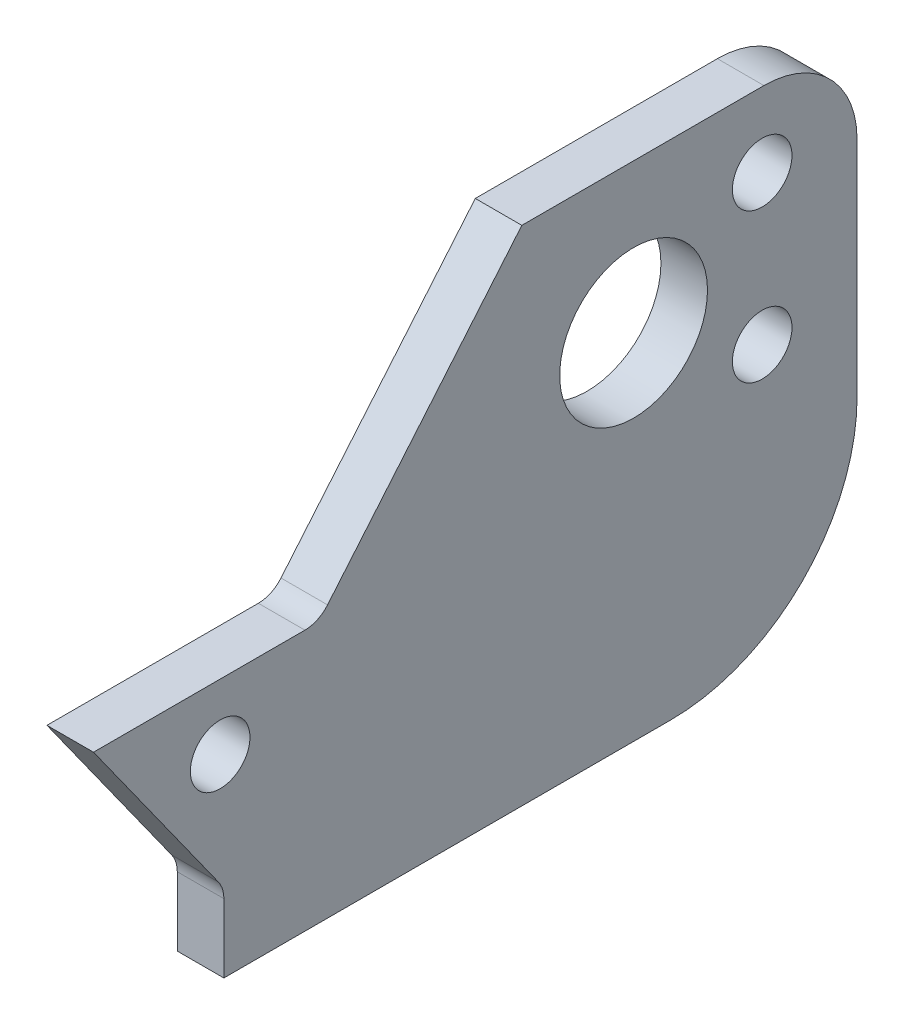
ISO-10303-21;
HEADER;
FILE_DESCRIPTION(('STEP AP214'),'2;1');
FILE_NAME('part.step','',(''),(''),'','','');
FILE_SCHEMA(('AUTOMOTIVE_DESIGN { 1 0 10303 214 1 1 1 1 }'));
ENDSEC;
DATA;
#1=APPLICATION_CONTEXT('core data for automotive mechanical design processes');
#2=APPLICATION_PROTOCOL_DEFINITION('international standard','automotive_design',2000,#1);
#3=PRODUCT_CONTEXT('',#1,'mechanical');
#4=PRODUCT('Part','Part','',(#3));
#5=PRODUCT_RELATED_PRODUCT_CATEGORY('part','',(#4));
#6=PRODUCT_DEFINITION_FORMATION('','',#4);
#7=PRODUCT_DEFINITION_CONTEXT('part definition',#1,'design');
#8=PRODUCT_DEFINITION('design','',#6,#7);
#9=PRODUCT_DEFINITION_SHAPE('','',#8);
#10=(LENGTH_UNIT() NAMED_UNIT(*) SI_UNIT(.MILLI.,.METRE.));
#11=(NAMED_UNIT(*) PLANE_ANGLE_UNIT() SI_UNIT($,.RADIAN.));
#12=(NAMED_UNIT(*) SI_UNIT($,.STERADIAN.) SOLID_ANGLE_UNIT());
#13=UNCERTAINTY_MEASURE_WITH_UNIT(LENGTH_MEASURE(1.E-05),#10,'distance_accuracy_value','');
#14=(GEOMETRIC_REPRESENTATION_CONTEXT(3) GLOBAL_UNCERTAINTY_ASSIGNED_CONTEXT((#13)) GLOBAL_UNIT_ASSIGNED_CONTEXT((#10,
#11,#12)) REPRESENTATION_CONTEXT('',''));
#15=CARTESIAN_POINT('',(0.,0.,0.));
#16=DIRECTION('',(0.,0.,1.));
#17=DIRECTION('',(1.,0.,0.));
#18=AXIS2_PLACEMENT_3D('',#15,#16,#17);
#19=CARTESIAN_POINT('',(9.,6.99999999999999,0.));
#20=DIRECTION('',(0.,1.,0.));
#21=DIRECTION('',(0.,0.,1.));
#22=AXIS2_PLACEMENT_3D('',#19,#20,#21);
#23=PLANE('',#22);
#24=DIRECTION('',(0.,0.,-1.));
#25=VECTOR('',#24,1.);
#26=CARTESIAN_POINT('',(-6.5,6.99999999999999,0.));
#27=LINE('',#26,#25);
#28=CARTESIAN_POINT('',(-6.5,7.,41.));
#29=VERTEX_POINT('',#28);
#30=CARTESIAN_POINT('',(-6.5,6.99999999999999,29.6485586126258));
#31=VERTEX_POINT('',#30);
#32=EDGE_CURVE('E158',#29,#31,#27,.T.);
#33=ORIENTED_EDGE('',*,*,#32,.T.);
#34=DIRECTION('',(-1.,0.,0.));
#35=VECTOR('',#34,1.);
#36=CARTESIAN_POINT('',(9.,6.99999999999999,29.6485586126258));
#37=LINE('',#36,#35);
#38=CARTESIAN_POINT('',(-9.,6.99999999999999,29.6485586126258));
#39=VERTEX_POINT('',#38);
#40=EDGE_CURVE('E232',#31,#39,#37,.T.);
#41=ORIENTED_EDGE('',*,*,#40,.T.);
#42=DIRECTION('',(0.,0.,-1.));
#43=VECTOR('',#42,1.);
#44=CARTESIAN_POINT('',(-9.,6.99999999999999,0.));
#45=LINE('',#44,#43);
#46=CARTESIAN_POINT('',(-9.,7.,41.));
#47=VERTEX_POINT('',#46);
#48=EDGE_CURVE('E161',#47,#39,#45,.T.);
#49=ORIENTED_EDGE('',*,*,#48,.F.);
#50=DIRECTION('',(-1.,0.,0.));
#51=VECTOR('',#50,1.);
#52=CARTESIAN_POINT('',(-6.5,7.,41.));
#53=LINE('',#52,#51);
#54=EDGE_CURVE('E146',#29,#47,#53,.T.);
#55=ORIENTED_EDGE('',*,*,#54,.F.);
#56=EDGE_LOOP('',(#33,#41,#49,#55));
#57=FACE_BOUND('',#56,.T.);
#58=ADVANCED_FACE('F64',(#57),#23,.T.);
#59=CARTESIAN_POINT('',(9.,-6.99999999999999,0.));
#60=DIRECTION('',(0.,1.,0.));
#61=DIRECTION('',(0.,0.,1.));
#62=AXIS2_PLACEMENT_3D('',#59,#60,#61);
#63=PLANE('',#62);
#64=DIRECTION('',(0.,0.,-1.));
#65=VECTOR('',#64,1.);
#66=CARTESIAN_POINT('',(-6.5,-6.99999999999999,0.));
#67=LINE('',#66,#65);
#68=CARTESIAN_POINT('',(-6.5,-7.,34.));
#69=VERTEX_POINT('',#68);
#70=CARTESIAN_POINT('',(-6.5,-7.,10.));
#71=VERTEX_POINT('',#70);
#72=EDGE_CURVE('E300',#69,#71,#67,.T.);
#73=ORIENTED_EDGE('',*,*,#72,.F.);
#74=DIRECTION('',(-1.,0.,0.));
#75=VECTOR('',#74,1.);
#76=CARTESIAN_POINT('',(-6.5,-7.00000000000001,34.));
#77=LINE('',#76,#75);
#78=CARTESIAN_POINT('',(-9.,-7.00000000000001,34.));
#79=VERTEX_POINT('',#78);
#80=EDGE_CURVE('E164',#69,#79,#77,.T.);
#81=ORIENTED_EDGE('',*,*,#80,.T.);
#82=DIRECTION('',(0.,0.,-1.));
#83=VECTOR('',#82,1.);
#84=CARTESIAN_POINT('',(-9.,-6.99999999999999,0.));
#85=LINE('',#84,#83);
#86=CARTESIAN_POINT('',(-9.,-7.,10.));
#87=VERTEX_POINT('',#86);
#88=EDGE_CURVE('E190',#79,#87,#85,.T.);
#89=ORIENTED_EDGE('',*,*,#88,.T.);
#90=DIRECTION('',(-1.,0.,0.));
#91=VECTOR('',#90,1.);
#92=CARTESIAN_POINT('',(-6.5,-7.,10.));
#93=LINE('',#92,#91);
#94=EDGE_CURVE('E225',#87,#71,#93,.F.);
#95=ORIENTED_EDGE('',*,*,#94,.T.);
#96=EDGE_LOOP('',(#73,#81,#89,#95));
#97=FACE_BOUND('',#96,.T.);
#98=ADVANCED_FACE('F265',(#97),#63,.F.);
#99=CARTESIAN_POINT('',(9.,20.,0.));
#100=DIRECTION('',(0.,1.,0.));
#101=DIRECTION('',(0.,0.,1.));
#102=AXIS2_PLACEMENT_3D('',#99,#100,#101);
#103=PLANE('',#102);
#104=DIRECTION('',(0.,0.,-1.));
#105=VECTOR('',#104,1.);
#106=CARTESIAN_POINT('',(-6.5,20.,0.));
#107=LINE('',#106,#105);
#108=CARTESIAN_POINT('',(-6.5,20.,18.));
#109=VERTEX_POINT('',#108);
#110=CARTESIAN_POINT('',(-6.5,20.,5.));
#111=VERTEX_POINT('',#110);
#112=EDGE_CURVE('E181',#109,#111,#107,.T.);
#113=ORIENTED_EDGE('',*,*,#112,.T.);
#114=DIRECTION('',(-1.,0.,0.));
#115=VECTOR('',#114,1.);
#116=CARTESIAN_POINT('',(9.,20.,5.));
#117=LINE('',#116,#115);
#118=CARTESIAN_POINT('',(-9.,20.,5.));
#119=VERTEX_POINT('',#118);
#120=EDGE_CURVE('E204',#111,#119,#117,.T.);
#121=ORIENTED_EDGE('',*,*,#120,.T.);
#122=DIRECTION('',(0.,0.,-1.));
#123=VECTOR('',#122,1.);
#124=CARTESIAN_POINT('',(-9.,20.,0.));
#125=LINE('',#124,#123);
#126=CARTESIAN_POINT('',(-9.,20.,18.));
#127=VERTEX_POINT('',#126);
#128=EDGE_CURVE('E172',#127,#119,#125,.T.);
#129=ORIENTED_EDGE('',*,*,#128,.F.);
#130=DIRECTION('',(-1.,0.,0.));
#131=VECTOR('',#130,1.);
#132=CARTESIAN_POINT('',(9.,20.,18.));
#133=LINE('',#132,#131);
#134=EDGE_CURVE('E197',#109,#127,#133,.T.);
#135=ORIENTED_EDGE('',*,*,#134,.F.);
#136=EDGE_LOOP('',(#113,#121,#129,#135));
#137=FACE_BOUND('',#136,.T.);
#138=ADVANCED_FACE('F271',(#137),#103,.T.);
#139=CARTESIAN_POINT('',(9.,17.1267880004407,20.4109111291244));
#140=DIRECTION('',(0.,-0.642787609686543,-0.766044443118975));
#141=DIRECTION('',(0.,0.766044443118975,-0.642787609686543));
#142=AXIS2_PLACEMENT_3D('',#139,#140,#141);
#143=PLANE('',#142);
#144=DIRECTION('',(0.,-0.766044443118975,0.642787609686543));
#145=VECTOR('',#144,1.);
#146=CARTESIAN_POINT('',(-9.,17.1267880004407,20.4109111291244));
#147=LINE('',#146,#145);
#148=CARTESIAN_POINT('',(-9.,7.5670746696226,28.4324630591744));
#149=VERTEX_POINT('',#148);
#150=EDGE_CURVE('E179',#127,#149,#147,.T.);
#151=ORIENTED_EDGE('',*,*,#150,.T.);
#152=DIRECTION('',(-1.,0.,0.));
#153=VECTOR('',#152,1.);
#154=CARTESIAN_POINT('',(9.,7.5670746696226,28.4324630591744));
#155=LINE('',#154,#153);
#156=CARTESIAN_POINT('',(-6.5,7.5670746696226,28.4324630591744));
#157=VERTEX_POINT('',#156);
#158=EDGE_CURVE('E234',#149,#157,#155,.F.);
#159=ORIENTED_EDGE('',*,*,#158,.T.);
#160=DIRECTION('',(0.,-0.766044443118975,0.642787609686543));
#161=VECTOR('',#160,1.);
#162=CARTESIAN_POINT('',(-6.5,17.1267880004407,20.4109111291244));
#163=LINE('',#162,#161);
#164=EDGE_CURVE('E173',#109,#157,#163,.T.);
#165=ORIENTED_EDGE('',*,*,#164,.F.);
#166=ORIENTED_EDGE('',*,*,#134,.T.);
#167=EDGE_LOOP('',(#151,#159,#165,#166));
#168=FACE_BOUND('',#167,.T.);
#169=ADVANCED_FACE('F248',(#168),#143,.F.);
#170=CARTESIAN_POINT('',(9.,0.,0.));
#171=DIRECTION('',(0.,0.,-1.));
#172=DIRECTION('',(0.,1.,0.));
#173=AXIS2_PLACEMENT_3D('',#170,#171,#172);
#174=PLANE('',#173);
#175=DIRECTION('',(0.,-1.,0.));
#176=VECTOR('',#175,1.);
#177=CARTESIAN_POINT('',(-6.5,0.,0.));
#178=LINE('',#177,#176);
#179=CARTESIAN_POINT('',(-6.5,15.,0.));
#180=VERTEX_POINT('',#179);
#181=CARTESIAN_POINT('',(-6.5,3.,0.));
#182=VERTEX_POINT('',#181);
#183=EDGE_CURVE('E200',#180,#182,#178,.T.);
#184=ORIENTED_EDGE('',*,*,#183,.T.);
#185=DIRECTION('',(-1.,0.,0.));
#186=VECTOR('',#185,1.);
#187=CARTESIAN_POINT('',(-9.,3.,0.));
#188=LINE('',#187,#186);
#189=CARTESIAN_POINT('',(-9.,3.,0.));
#190=VERTEX_POINT('',#189);
#191=EDGE_CURVE('E217',#182,#190,#188,.T.);
#192=ORIENTED_EDGE('',*,*,#191,.T.);
#193=DIRECTION('',(0.,-1.,0.));
#194=VECTOR('',#193,1.);
#195=CARTESIAN_POINT('',(-9.,0.,0.));
#196=LINE('',#195,#194);
#197=CARTESIAN_POINT('',(-9.,15.,0.));
#198=VERTEX_POINT('',#197);
#199=EDGE_CURVE('E193',#198,#190,#196,.T.);
#200=ORIENTED_EDGE('',*,*,#199,.F.);
#201=DIRECTION('',(-1.,0.,0.));
#202=VECTOR('',#201,1.);
#203=CARTESIAN_POINT('',(9.,15.,0.));
#204=LINE('',#203,#202);
#205=EDGE_CURVE('E211',#198,#180,#204,.F.);
#206=ORIENTED_EDGE('',*,*,#205,.T.);
#207=EDGE_LOOP('',(#184,#192,#200,#206));
#208=FACE_BOUND('',#207,.T.);
#209=ADVANCED_FACE('F277',(#208),#174,.T.);
#210=CARTESIAN_POINT('',(-9.,0.,0.));
#211=DIRECTION('',(1.,0.,0.));
#212=DIRECTION('',(0.,0.,-1.));
#213=AXIS2_PLACEMENT_3D('',#210,#211,#212);
#214=PLANE('',#213);
#215=CARTESIAN_POINT('',(-9.,3.5,34.1988373664787));
#216=DIRECTION('',(-1.,0.,0.));
#217=DIRECTION('',(0.,0.,1.));
#218=AXIS2_PLACEMENT_3D('',#215,#216,#217);
#219=CIRCLE('',#218,1.59999999999999);
#220=CARTESIAN_POINT('',(-9.,3.5,35.7988373664787));
#221=VERTEX_POINT('',#220);
#222=EDGE_CURVE('E348',#221,#221,#219,.T.);
#223=ORIENTED_EDGE('',*,*,#222,.F.);
#224=EDGE_LOOP('',(#223));
#225=FACE_BOUND('',#224,.T.);
#226=CARTESIAN_POINT('',(-9.,8.,5.0949004351856));
#227=DIRECTION('',(-1.,0.,0.));
#228=DIRECTION('',(0.,0.,1.));
#229=AXIS2_PLACEMENT_3D('',#226,#227,#228);
#230=CIRCLE('',#229,1.59999999999999);
#231=CARTESIAN_POINT('',(-9.,8.,6.69490043518559));
#232=VERTEX_POINT('',#231);
#233=EDGE_CURVE('E340',#232,#232,#230,.T.);
#234=ORIENTED_EDGE('',*,*,#233,.F.);
#235=EDGE_LOOP('',(#234));
#236=FACE_BOUND('',#235,.T.);
#237=CARTESIAN_POINT('',(-9.,16.,5.0949004351856));
#238=DIRECTION('',(-1.,0.,0.));
#239=DIRECTION('',(0.,0.,1.));
#240=AXIS2_PLACEMENT_3D('',#237,#238,#239);
#241=CIRCLE('',#240,1.59999999999999);
#242=CARTESIAN_POINT('',(-9.,16.,6.69490043518559));
#243=VERTEX_POINT('',#242);
#244=EDGE_CURVE('E332',#243,#243,#241,.T.);
#245=ORIENTED_EDGE('',*,*,#244,.F.);
#246=EDGE_LOOP('',(#245));
#247=FACE_BOUND('',#246,.T.);
#248=CARTESIAN_POINT('',(-9.,12.,12.));
#249=DIRECTION('',(1.,0.,0.));
#250=DIRECTION('',(0.,0.,-1.));
#251=AXIS2_PLACEMENT_3D('',#248,#249,#250);
#252=CIRCLE('',#251,3.96875);
#253=CARTESIAN_POINT('',(-9.,12.,8.03125));
#254=VERTEX_POINT('',#253);
#255=EDGE_CURVE('E309',#254,#254,#252,.T.);
#256=ORIENTED_EDGE('',*,*,#255,.T.);
#257=EDGE_LOOP('',(#256));
#258=FACE_BOUND('',#257,.T.);
#259=DIRECTION('',(0.,-1.,0.));
#260=VECTOR('',#259,1.);
#261=CARTESIAN_POINT('',(-9.,-2.79999999999999,34.));
#262=LINE('',#261,#260);
#263=CARTESIAN_POINT('',(-9.,-3.30873827228603,34.));
#264=VERTEX_POINT('',#263);
#265=EDGE_CURVE('E152',#264,#79,#262,.T.);
#266=ORIENTED_EDGE('',*,*,#265,.F.);
#267=CARTESIAN_POINT('',(-9.,-3.30873827228603,35.5875));
#268=DIRECTION('',(1.,0.,0.));
#269=DIRECTION('',(0.,0.,-1.));
#270=AXIS2_PLACEMENT_3D('',#267,#268,#269);
#271=CIRCLE('',#270,1.5875);
#272=CARTESIAN_POINT('',(-9.,-2.38602263975696,34.2956981144593));
#273=VERTEX_POINT('',#272);
#274=EDGE_CURVE('E72',#264,#273,#271,.T.);
#275=ORIENTED_EDGE('',*,*,#274,.T.);
#276=DIRECTION('',(0.,-0.813733471206735,-0.581238193719097));
#277=VECTOR('',#276,1.);
#278=CARTESIAN_POINT('',(-9.,7.,41.));
#279=LINE('',#278,#277);
#280=EDGE_CURVE('E323',#47,#273,#279,.T.);
#281=ORIENTED_EDGE('',*,*,#280,.F.);
#282=ORIENTED_EDGE('',*,*,#48,.T.);
#283=CARTESIAN_POINT('',(-9.,8.5875,29.6485586126258));
#284=DIRECTION('',(1.,0.,0.));
#285=DIRECTION('',(0.,0.,-1.));
#286=AXIS2_PLACEMENT_3D('',#283,#284,#285);
#287=CIRCLE('',#286,1.5875);
#288=EDGE_CURVE('E240',#39,#149,#287,.T.);
#289=ORIENTED_EDGE('',*,*,#288,.T.);
#290=ORIENTED_EDGE('',*,*,#150,.F.);
#291=ORIENTED_EDGE('',*,*,#128,.T.);
#292=CARTESIAN_POINT('',(-9.,15.,5.));
#293=DIRECTION('',(1.,0.,0.));
#294=DIRECTION('',(0.,0.,-1.));
#295=AXIS2_PLACEMENT_3D('',#292,#293,#294);
#296=CIRCLE('',#295,5.);
#297=EDGE_CURVE('E208',#119,#198,#296,.F.);
#298=ORIENTED_EDGE('',*,*,#297,.T.);
#299=ORIENTED_EDGE('',*,*,#199,.T.);
#300=CARTESIAN_POINT('',(-9.,3.,10.));
#301=DIRECTION('',(1.,0.,0.));
#302=DIRECTION('',(0.,0.,-1.));
#303=AXIS2_PLACEMENT_3D('',#300,#301,#302);
#304=CIRCLE('',#303,10.);
#305=EDGE_CURVE('E221',#190,#87,#304,.F.);
#306=ORIENTED_EDGE('',*,*,#305,.T.);
#307=ORIENTED_EDGE('',*,*,#88,.F.);
#308=EDGE_LOOP('',(#266,#275,#281,#282,#289,#290,#291,#298,#299,#306,#307));
#309=FACE_BOUND('',#308,.T.);
#310=ADVANCED_FACE('F243',(#225,#236,#247,#258,#309),#214,.F.);
#311=CARTESIAN_POINT('',(-6.5,0.,0.));
#312=DIRECTION('',(1.,0.,0.));
#313=DIRECTION('',(0.,0.,-1.));
#314=AXIS2_PLACEMENT_3D('',#311,#312,#313);
#315=PLANE('',#314);
#316=CARTESIAN_POINT('',(-6.5,3.5,34.1988373664787));
#317=DIRECTION('',(1.,0.,0.));
#318=DIRECTION('',(0.,0.,-1.));
#319=AXIS2_PLACEMENT_3D('',#316,#317,#318);
#320=CIRCLE('',#319,1.59999999999999);
#321=CARTESIAN_POINT('',(-6.5,3.5,32.5988373664787));
#322=VERTEX_POINT('',#321);
#323=EDGE_CURVE('E344',#322,#322,#320,.F.);
#324=ORIENTED_EDGE('',*,*,#323,.T.);
#325=EDGE_LOOP('',(#324));
#326=FACE_BOUND('',#325,.T.);
#327=CARTESIAN_POINT('',(-6.5,8.,5.0949004351856));
#328=DIRECTION('',(1.,0.,0.));
#329=DIRECTION('',(0.,0.,-1.));
#330=AXIS2_PLACEMENT_3D('',#327,#328,#329);
#331=CIRCLE('',#330,1.59999999999999);
#332=CARTESIAN_POINT('',(-6.5,8.,3.4949004351856));
#333=VERTEX_POINT('',#332);
#334=EDGE_CURVE('E336',#333,#333,#331,.F.);
#335=ORIENTED_EDGE('',*,*,#334,.T.);
#336=EDGE_LOOP('',(#335));
#337=FACE_BOUND('',#336,.T.);
#338=CARTESIAN_POINT('',(-6.5,16.,5.0949004351856));
#339=DIRECTION('',(1.,0.,0.));
#340=DIRECTION('',(0.,0.,-1.));
#341=AXIS2_PLACEMENT_3D('',#338,#339,#340);
#342=CIRCLE('',#341,1.6);
#343=CARTESIAN_POINT('',(-6.5,16.,3.4949004351856));
#344=VERTEX_POINT('',#343);
#345=EDGE_CURVE('E326',#344,#344,#342,.F.);
#346=ORIENTED_EDGE('',*,*,#345,.T.);
#347=EDGE_LOOP('',(#346));
#348=FACE_BOUND('',#347,.T.);
#349=DIRECTION('',(0.,-0.813733471206735,-0.581238193719097));
#350=VECTOR('',#349,1.);
#351=CARTESIAN_POINT('',(-6.5,7.,41.));
#352=LINE('',#351,#350);
#353=CARTESIAN_POINT('',(-6.5,-2.38602263975696,34.2956981144593));
#354=VERTEX_POINT('',#353);
#355=EDGE_CURVE('E143',#29,#354,#352,.T.);
#356=ORIENTED_EDGE('',*,*,#355,.T.);
#357=CARTESIAN_POINT('',(-6.5,-3.30873827228603,35.5875));
#358=DIRECTION('',(1.,0.,0.));
#359=DIRECTION('',(0.,0.,-1.));
#360=AXIS2_PLACEMENT_3D('',#357,#358,#359);
#361=CIRCLE('',#360,1.5875);
#362=CARTESIAN_POINT('',(-6.5,-3.30873827228603,34.));
#363=VERTEX_POINT('',#362);
#364=EDGE_CURVE('E12',#354,#363,#361,.F.);
#365=ORIENTED_EDGE('',*,*,#364,.T.);
#366=DIRECTION('',(0.,-1.,0.));
#367=VECTOR('',#366,1.);
#368=CARTESIAN_POINT('',(-6.5,-2.79999999999999,34.));
#369=LINE('',#368,#367);
#370=EDGE_CURVE('E151',#363,#69,#369,.T.);
#371=ORIENTED_EDGE('',*,*,#370,.T.);
#372=ORIENTED_EDGE('',*,*,#72,.T.);
#373=CARTESIAN_POINT('',(-6.5,3.,10.));
#374=DIRECTION('',(1.,0.,0.));
#375=DIRECTION('',(0.,0.,-1.));
#376=AXIS2_PLACEMENT_3D('',#373,#374,#375);
#377=CIRCLE('',#376,10.);
#378=EDGE_CURVE('E229',#71,#182,#377,.T.);
#379=ORIENTED_EDGE('',*,*,#378,.T.);
#380=ORIENTED_EDGE('',*,*,#183,.F.);
#381=CARTESIAN_POINT('',(-6.5,15.,5.));
#382=DIRECTION('',(1.,0.,0.));
#383=DIRECTION('',(0.,0.,-1.));
#384=AXIS2_PLACEMENT_3D('',#381,#382,#383);
#385=CIRCLE('',#384,5.);
#386=EDGE_CURVE('E214',#180,#111,#385,.T.);
#387=ORIENTED_EDGE('',*,*,#386,.T.);
#388=ORIENTED_EDGE('',*,*,#112,.F.);
#389=ORIENTED_EDGE('',*,*,#164,.T.);
#390=CARTESIAN_POINT('',(-6.5,8.5875,29.6485586126258));
#391=DIRECTION('',(1.,0.,0.));
#392=DIRECTION('',(0.,0.,-1.));
#393=AXIS2_PLACEMENT_3D('',#390,#391,#392);
#394=CIRCLE('',#393,1.5875);
#395=EDGE_CURVE('E170',#157,#31,#394,.F.);
#396=ORIENTED_EDGE('',*,*,#395,.T.);
#397=ORIENTED_EDGE('',*,*,#32,.F.);
#398=EDGE_LOOP('',(#356,#365,#371,#372,#379,#380,#387,#388,#389,#396,#397));
#399=FACE_BOUND('',#398,.T.);
#400=CARTESIAN_POINT('',(-6.5,12.,12.));
#401=DIRECTION('',(1.,0.,0.));
#402=DIRECTION('',(0.,0.,-1.));
#403=AXIS2_PLACEMENT_3D('',#400,#401,#402);
#404=CIRCLE('',#403,3.96875);
#405=CARTESIAN_POINT('',(-6.5,12.,8.03125));
#406=VERTEX_POINT('',#405);
#407=EDGE_CURVE('E163',#406,#406,#404,.T.);
#408=ORIENTED_EDGE('',*,*,#407,.F.);
#409=EDGE_LOOP('',(#408));
#410=FACE_BOUND('',#409,.T.);
#411=ADVANCED_FACE('F166',(#326,#337,#348,#399,#410),#315,.T.);
#412=CARTESIAN_POINT('',(-12.5,12.,12.));
#413=DIRECTION('',(1.,0.,0.));
#414=DIRECTION('',(0.,0.,-1.));
#415=AXIS2_PLACEMENT_3D('',#412,#413,#414);
#416=CYLINDRICAL_SURFACE('',#415,3.96875);
#417=ORIENTED_EDGE('',*,*,#407,.T.);
#418=EDGE_LOOP('',(#417));
#419=FACE_BOUND('',#418,.T.);
#420=ORIENTED_EDGE('',*,*,#255,.F.);
#421=EDGE_LOOP('',(#420));
#422=FACE_BOUND('',#421,.T.);
#423=ADVANCED_FACE('F284',(#419,#422),#416,.F.);
#424=CARTESIAN_POINT('',(9.,15.,5.));
#425=DIRECTION('',(-1.,0.,0.));
#426=DIRECTION('',(0.,0.,1.));
#427=AXIS2_PLACEMENT_3D('',#424,#425,#426);
#428=CYLINDRICAL_SURFACE('',#427,5.);
#429=ORIENTED_EDGE('',*,*,#386,.F.);
#430=ORIENTED_EDGE('',*,*,#205,.F.);
#431=ORIENTED_EDGE('',*,*,#297,.F.);
#432=ORIENTED_EDGE('',*,*,#120,.F.);
#433=EDGE_LOOP('',(#429,#430,#431,#432));
#434=FACE_BOUND('',#433,.T.);
#435=ADVANCED_FACE('F281',(#434),#428,.T.);
#436=CARTESIAN_POINT('',(9.,3.,10.));
#437=DIRECTION('',(1.,0.,0.));
#438=DIRECTION('',(0.,0.,-1.));
#439=AXIS2_PLACEMENT_3D('',#436,#437,#438);
#440=CYLINDRICAL_SURFACE('',#439,10.);
#441=ORIENTED_EDGE('',*,*,#378,.F.);
#442=ORIENTED_EDGE('',*,*,#94,.F.);
#443=ORIENTED_EDGE('',*,*,#305,.F.);
#444=ORIENTED_EDGE('',*,*,#191,.F.);
#445=EDGE_LOOP('',(#441,#442,#443,#444));
#446=FACE_BOUND('',#445,.T.);
#447=ADVANCED_FACE('F283',(#446),#440,.T.);
#448=CARTESIAN_POINT('',(-6.5,7.,41.));
#449=DIRECTION('',(0.,0.581238193719097,-0.813733471206735));
#450=DIRECTION('',(0.,0.813733471206735,0.581238193719097));
#451=AXIS2_PLACEMENT_3D('',#448,#449,#450);
#452=PLANE('',#451);
#453=ORIENTED_EDGE('',*,*,#280,.T.);
#454=DIRECTION('',(-1.,0.,0.));
#455=VECTOR('',#454,1.);
#456=CARTESIAN_POINT('',(-6.5,-2.38602263975696,34.2956981144593));
#457=LINE('',#456,#455);
#458=EDGE_CURVE('E79',#273,#354,#457,.F.);
#459=ORIENTED_EDGE('',*,*,#458,.T.);
#460=ORIENTED_EDGE('',*,*,#355,.F.);
#461=ORIENTED_EDGE('',*,*,#54,.T.);
#462=EDGE_LOOP('',(#453,#459,#460,#461));
#463=FACE_BOUND('',#462,.T.);
#464=ADVANCED_FACE('F145',(#463),#452,.F.);
#465=CARTESIAN_POINT('',(-6.5,-2.79999999999999,34.));
#466=DIRECTION('',(0.,0.,-1.));
#467=DIRECTION('',(-1.,0.,0.));
#468=AXIS2_PLACEMENT_3D('',#465,#466,#467);
#469=PLANE('',#468);
#470=ORIENTED_EDGE('',*,*,#370,.F.);
#471=DIRECTION('',(-1.,0.,0.));
#472=VECTOR('',#471,1.);
#473=CARTESIAN_POINT('',(-9.,-3.30873827228603,34.));
#474=LINE('',#473,#472);
#475=EDGE_CURVE('E236',#363,#264,#474,.T.);
#476=ORIENTED_EDGE('',*,*,#475,.T.);
#477=ORIENTED_EDGE('',*,*,#265,.T.);
#478=ORIENTED_EDGE('',*,*,#80,.F.);
#479=EDGE_LOOP('',(#470,#476,#477,#478));
#480=FACE_BOUND('',#479,.T.);
#481=ADVANCED_FACE('F292',(#480),#469,.F.);
#482=CARTESIAN_POINT('',(-9.,16.,5.0949004351856));
#483=DIRECTION('',(-1.,0.,0.));
#484=DIRECTION('',(0.,0.,1.));
#485=AXIS2_PLACEMENT_3D('',#482,#483,#484);
#486=CYLINDRICAL_SURFACE('',#485,1.6);
#487=ORIENTED_EDGE('',*,*,#345,.F.);
#488=EDGE_LOOP('',(#487));
#489=FACE_BOUND('',#488,.T.);
#490=ORIENTED_EDGE('',*,*,#244,.T.);
#491=EDGE_LOOP('',(#490));
#492=FACE_BOUND('',#491,.T.);
#493=ADVANCED_FACE('F431',(#489,#492),#486,.F.);
#494=CARTESIAN_POINT('',(-9.,8.,5.0949004351856));
#495=DIRECTION('',(-1.,0.,0.));
#496=DIRECTION('',(0.,0.,1.));
#497=AXIS2_PLACEMENT_3D('',#494,#495,#496);
#498=CYLINDRICAL_SURFACE('',#497,1.59999999999999);
#499=ORIENTED_EDGE('',*,*,#334,.F.);
#500=EDGE_LOOP('',(#499));
#501=FACE_BOUND('',#500,.T.);
#502=ORIENTED_EDGE('',*,*,#233,.T.);
#503=EDGE_LOOP('',(#502));
#504=FACE_BOUND('',#503,.T.);
#505=ADVANCED_FACE('F260',(#501,#504),#498,.F.);
#506=CARTESIAN_POINT('',(-9.,3.5,34.1988373664787));
#507=DIRECTION('',(-1.,0.,0.));
#508=DIRECTION('',(0.,0.,1.));
#509=AXIS2_PLACEMENT_3D('',#506,#507,#508);
#510=CYLINDRICAL_SURFACE('',#509,1.59999999999999);
#511=ORIENTED_EDGE('',*,*,#323,.F.);
#512=EDGE_LOOP('',(#511));
#513=FACE_BOUND('',#512,.T.);
#514=ORIENTED_EDGE('',*,*,#222,.T.);
#515=EDGE_LOOP('',(#514));
#516=FACE_BOUND('',#515,.T.);
#517=ADVANCED_FACE('F253',(#513,#516),#510,.F.);
#518=CARTESIAN_POINT('',(9.,8.5875,29.6485586126258));
#519=DIRECTION('',(-1.,0.,0.));
#520=DIRECTION('',(0.,0.,1.));
#521=AXIS2_PLACEMENT_3D('',#518,#519,#520);
#522=CYLINDRICAL_SURFACE('',#521,1.5875);
#523=ORIENTED_EDGE('',*,*,#395,.F.);
#524=ORIENTED_EDGE('',*,*,#158,.F.);
#525=ORIENTED_EDGE('',*,*,#288,.F.);
#526=ORIENTED_EDGE('',*,*,#40,.F.);
#527=EDGE_LOOP('',(#523,#524,#525,#526));
#528=FACE_BOUND('',#527,.T.);
#529=ADVANCED_FACE('F251',(#528),#522,.F.);
#530=CARTESIAN_POINT('',(-6.5,-3.30873827228603,35.5875));
#531=DIRECTION('',(1.,0.,0.));
#532=DIRECTION('',(0.,0.,-1.));
#533=AXIS2_PLACEMENT_3D('',#530,#531,#532);
#534=CYLINDRICAL_SURFACE('',#533,1.5875);
#535=ORIENTED_EDGE('',*,*,#364,.F.);
#536=ORIENTED_EDGE('',*,*,#458,.F.);
#537=ORIENTED_EDGE('',*,*,#274,.F.);
#538=ORIENTED_EDGE('',*,*,#475,.F.);
#539=EDGE_LOOP('',(#535,#536,#537,#538));
#540=FACE_BOUND('',#539,.T.);
#541=ADVANCED_FACE('F66',(#540),#534,.F.);
#542=CLOSED_SHELL('',(#58,#98,#138,#169,#209,#310,#411,#423,#435,#447,#464,#481,#493,#505,#517,
#529,#541));
#543=MANIFOLD_SOLID_BREP('B2',#542);
#544=ADVANCED_BREP_SHAPE_REPRESENTATION('',(#18,#543),#14);
#545=SHAPE_DEFINITION_REPRESENTATION(#9,#544);
ENDSEC;
END-ISO-10303-21;
